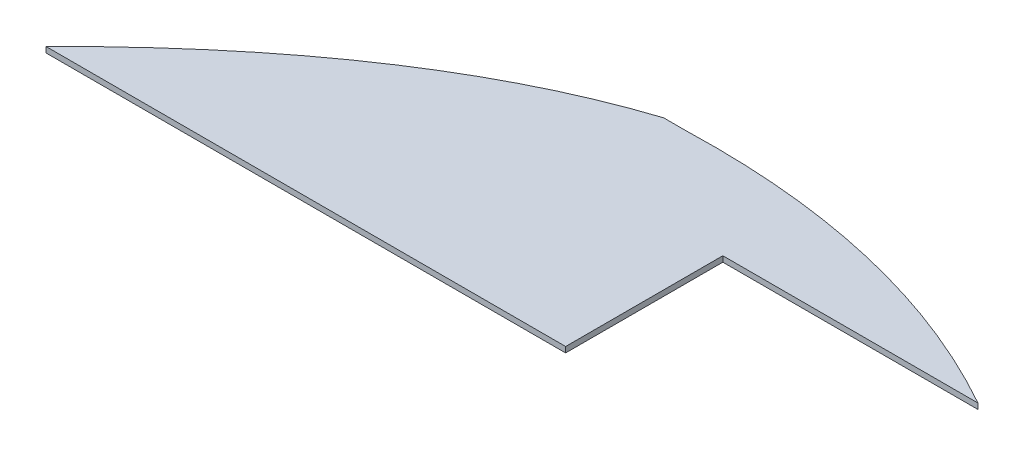
ISO-10303-21;
HEADER;
FILE_DESCRIPTION(('STEP AP214'),'2;1');
FILE_NAME('part.step','',(''),(''),'','','');
FILE_SCHEMA(('AUTOMOTIVE_DESIGN { 1 0 10303 214 1 1 1 1 }'));
ENDSEC;
DATA;
#1=APPLICATION_CONTEXT('core data for automotive mechanical design processes');
#2=APPLICATION_PROTOCOL_DEFINITION('international standard','automotive_design',2000,#1);
#3=PRODUCT_CONTEXT('',#1,'mechanical');
#4=PRODUCT('Part','Part','',(#3));
#5=PRODUCT_RELATED_PRODUCT_CATEGORY('part','',(#4));
#6=PRODUCT_DEFINITION_FORMATION('','',#4);
#7=PRODUCT_DEFINITION_CONTEXT('part definition',#1,'design');
#8=PRODUCT_DEFINITION('design','',#6,#7);
#9=PRODUCT_DEFINITION_SHAPE('','',#8);
#10=(LENGTH_UNIT() NAMED_UNIT(*) SI_UNIT(.MILLI.,.METRE.));
#11=(NAMED_UNIT(*) PLANE_ANGLE_UNIT() SI_UNIT($,.RADIAN.));
#12=(NAMED_UNIT(*) SI_UNIT($,.STERADIAN.) SOLID_ANGLE_UNIT());
#13=UNCERTAINTY_MEASURE_WITH_UNIT(LENGTH_MEASURE(1.E-05),#10,'distance_accuracy_value','');
#14=(GEOMETRIC_REPRESENTATION_CONTEXT(3) GLOBAL_UNCERTAINTY_ASSIGNED_CONTEXT((#13)) GLOBAL_UNIT_ASSIGNED_CONTEXT((#10,
#11,#12)) REPRESENTATION_CONTEXT('',''));
#15=CARTESIAN_POINT('',(0.,0.,0.));
#16=DIRECTION('',(0.,0.,1.));
#17=DIRECTION('',(1.,0.,0.));
#18=AXIS2_PLACEMENT_3D('',#15,#16,#17);
#19=CARTESIAN_POINT('',(-923.849215906296,1396.06710603682,1121.25452346778));
#20=CARTESIAN_POINT('',(-783.090401046879,1396.06710603682,978.7666672417));
#21=CARTESIAN_POINT('',(-642.550953528989,1396.06710603682,886.467514623687));
#22=CARTESIAN_POINT('',(-504.749198230769,1396.06710603682,841.854556369505));
#23=B_SPLINE_CURVE_WITH_KNOTS('',3,(#19,#20,#21,#22),.UNSPECIFIED.,.F.,.F.,(4,4),(0.,1.),.UNSPECIFIED.);
#24=DIRECTION('',(0.,1.,0.));
#25=VECTOR('',#24,1.);
#26=SURFACE_OF_LINEAR_EXTRUSION('',#23,#25);
#27=CARTESIAN_POINT('',(-923.849215906296,1402.41710603682,1121.25452346778));
#28=CARTESIAN_POINT('',(-783.090401046879,1402.41710603682,978.7666672417));
#29=CARTESIAN_POINT('',(-642.550953528989,1402.41710603682,886.467514623687));
#30=CARTESIAN_POINT('',(-504.749198230769,1402.41710603682,841.854556369505));
#31=B_SPLINE_CURVE_WITH_KNOTS('',3,(#27,#28,#29,#30),.UNSPECIFIED.,.F.,.F.,(4,4),(0.,1.),.UNSPECIFIED.);
#32=CARTESIAN_POINT('',(-923.849215906296,1402.41710603682,1121.25452346778));
#33=VERTEX_POINT('',#32);
#34=CARTESIAN_POINT('',(-504.749198230769,1402.41710603682,841.854556369505));
#35=VERTEX_POINT('',#34);
#36=EDGE_CURVE('E118',#33,#35,#31,.T.);
#37=ORIENTED_EDGE('',*,*,#36,.T.);
#38=DIRECTION('',(0.,1.,0.));
#39=VECTOR('',#38,1.);
#40=CARTESIAN_POINT('',(-504.749198230769,1396.06710603682,841.854556369505));
#41=LINE('',#40,#39);
#42=CARTESIAN_POINT('',(-504.749198230769,1396.06710603682,841.854556369505));
#43=VERTEX_POINT('',#42);
#44=EDGE_CURVE('E11',#43,#35,#41,.T.);
#45=ORIENTED_EDGE('',*,*,#44,.F.);
#46=CARTESIAN_POINT('',(-923.849215906296,1396.06710603682,1121.25452346778));
#47=VERTEX_POINT('',#46);
#48=EDGE_CURVE('E138',#47,#43,#23,.T.);
#49=ORIENTED_EDGE('',*,*,#48,.F.);
#50=DIRECTION('',(0.,1.,0.));
#51=VECTOR('',#50,1.);
#52=CARTESIAN_POINT('',(-923.849215906296,1396.06710603682,1121.25452346778));
#53=LINE('',#52,#51);
#54=EDGE_CURVE('E114',#47,#33,#53,.T.);
#55=ORIENTED_EDGE('',*,*,#54,.T.);
#56=EDGE_LOOP('',(#37,#45,#49,#55));
#57=FACE_BOUND('',#56,.T.);
#58=ADVANCED_FACE('F33',(#57),#26,.F.);
#59=CARTESIAN_POINT('',(-479.34919823077,1396.06710603682,841.854556369505));
#60=DIRECTION('',(0.,0.,1.));
#61=DIRECTION('',(0.,-1.,0.));
#62=AXIS2_PLACEMENT_3D('',#59,#60,#61);
#63=PLANE('',#62);
#64=DIRECTION('',(1.,0.,0.));
#65=VECTOR('',#64,1.);
#66=CARTESIAN_POINT('',(-479.34919823077,1402.41710603682,841.854556369505));
#67=LINE('',#66,#65);
#68=CARTESIAN_POINT('',(-479.34919823077,1402.41710603682,841.854556369505));
#69=VERTEX_POINT('',#68);
#70=EDGE_CURVE('E123',#35,#69,#67,.T.);
#71=ORIENTED_EDGE('',*,*,#70,.T.);
#72=DIRECTION('',(0.,1.,0.));
#73=VECTOR('',#72,1.);
#74=CARTESIAN_POINT('',(-479.34919823077,1396.06710603682,841.854556369505));
#75=LINE('',#74,#73);
#76=CARTESIAN_POINT('',(-479.34919823077,1396.06710603682,841.854556369505));
#77=VERTEX_POINT('',#76);
#78=EDGE_CURVE('E42',#77,#69,#75,.T.);
#79=ORIENTED_EDGE('',*,*,#78,.F.);
#80=DIRECTION('',(1.,0.,0.));
#81=VECTOR('',#80,1.);
#82=CARTESIAN_POINT('',(-479.34919823077,1396.06710603682,841.854556369505));
#83=LINE('',#82,#81);
#84=EDGE_CURVE('E87',#43,#77,#83,.T.);
#85=ORIENTED_EDGE('',*,*,#84,.F.);
#86=ORIENTED_EDGE('',*,*,#44,.T.);
#87=EDGE_LOOP('',(#71,#79,#85,#86));
#88=FACE_BOUND('',#87,.T.);
#89=ADVANCED_FACE('F162',(#88),#63,.F.);
#90=CARTESIAN_POINT('',(-479.34919823077,1396.06710603682,841.854556369505));
#91=CARTESIAN_POINT('',(-241.540116372837,1396.06710603682,834.468534000656));
#92=CARTESIAN_POINT('',(-47.5491982307663,1396.06710603682,943.454556369519));
#93=B_SPLINE_CURVE_WITH_KNOTS('',2,(#90,#91,#92),.UNSPECIFIED.,.F.,.F.,(3,3),(0.,1.),.UNSPECIFIED.);
#94=DIRECTION('',(0.,1.,0.));
#95=VECTOR('',#94,1.);
#96=SURFACE_OF_LINEAR_EXTRUSION('',#93,#95);
#97=CARTESIAN_POINT('',(-479.34919823077,1402.41710603682,841.854556369505));
#98=CARTESIAN_POINT('',(-241.540116372837,1402.41710603682,834.468534000656));
#99=CARTESIAN_POINT('',(-47.5491982307663,1402.41710603682,943.454556369519));
#100=B_SPLINE_CURVE_WITH_KNOTS('',2,(#97,#98,#99),.UNSPECIFIED.,.F.,.F.,(3,3),(0.,1.),.UNSPECIFIED.);
#101=CARTESIAN_POINT('',(-47.5491982307664,1402.41710603682,943.454556369519));
#102=VERTEX_POINT('',#101);
#103=EDGE_CURVE('E128',#69,#102,#100,.T.);
#104=ORIENTED_EDGE('',*,*,#103,.T.);
#105=DIRECTION('',(0.,1.,0.));
#106=VECTOR('',#105,1.);
#107=CARTESIAN_POINT('',(-47.5491982307664,1396.06710603682,943.454556369519));
#108=LINE('',#107,#106);
#109=CARTESIAN_POINT('',(-47.5491982307664,1396.06710603682,943.454556369519));
#110=VERTEX_POINT('',#109);
#111=EDGE_CURVE('E109',#110,#102,#108,.T.);
#112=ORIENTED_EDGE('',*,*,#111,.F.);
#113=EDGE_CURVE('E100',#77,#110,#93,.T.);
#114=ORIENTED_EDGE('',*,*,#113,.F.);
#115=ORIENTED_EDGE('',*,*,#78,.T.);
#116=EDGE_LOOP('',(#104,#112,#114,#115));
#117=FACE_BOUND('',#116,.T.);
#118=ADVANCED_FACE('F144',(#117),#96,.F.);
#119=CARTESIAN_POINT('',(-336.146804180864,1396.06710603682,943.454556369515));
#120=DIRECTION('',(0.,0.,-1.));
#121=DIRECTION('',(-1.,0.,0.));
#122=AXIS2_PLACEMENT_3D('',#119,#120,#121);
#123=PLANE('',#122);
#124=DIRECTION('',(-1.,0.,0.));
#125=VECTOR('',#124,1.);
#126=CARTESIAN_POINT('',(-336.146804180864,1402.41710603682,943.454556369515));
#127=LINE('',#126,#125);
#128=CARTESIAN_POINT('',(-336.146804180864,1402.41710603682,943.454556369515));
#129=VERTEX_POINT('',#128);
#130=EDGE_CURVE('E108',#102,#129,#127,.T.);
#131=ORIENTED_EDGE('',*,*,#130,.T.);
#132=DIRECTION('',(0.,1.,0.));
#133=VECTOR('',#132,1.);
#134=CARTESIAN_POINT('',(-336.146804180864,1396.06710603682,943.454556369515));
#135=LINE('',#134,#133);
#136=CARTESIAN_POINT('',(-336.146804180864,1396.06710603682,943.454556369515));
#137=VERTEX_POINT('',#136);
#138=EDGE_CURVE('E105',#137,#129,#135,.T.);
#139=ORIENTED_EDGE('',*,*,#138,.F.);
#140=DIRECTION('',(-1.,0.,0.));
#141=VECTOR('',#140,1.);
#142=CARTESIAN_POINT('',(-336.146804180864,1396.06710603682,943.454556369515));
#143=LINE('',#142,#141);
#144=EDGE_CURVE('E94',#110,#137,#143,.T.);
#145=ORIENTED_EDGE('',*,*,#144,.F.);
#146=ORIENTED_EDGE('',*,*,#111,.T.);
#147=EDGE_LOOP('',(#131,#139,#145,#146));
#148=FACE_BOUND('',#147,.T.);
#149=ADVANCED_FACE('F106',(#148),#123,.F.);
#150=CARTESIAN_POINT('',(-336.146804180864,1396.06710603682,1121.25455636952));
#151=DIRECTION('',(-1.,0.,0.));
#152=DIRECTION('',(0.,0.,1.));
#153=AXIS2_PLACEMENT_3D('',#150,#151,#152);
#154=PLANE('',#153);
#155=DIRECTION('',(0.,0.,1.));
#156=VECTOR('',#155,1.);
#157=CARTESIAN_POINT('',(-336.146804180864,1402.41710603682,1121.25455636952));
#158=LINE('',#157,#156);
#159=CARTESIAN_POINT('',(-336.146804180864,1402.41710603682,1121.25455636952));
#160=VERTEX_POINT('',#159);
#161=EDGE_CURVE('E73',#129,#160,#158,.T.);
#162=ORIENTED_EDGE('',*,*,#161,.T.);
#163=DIRECTION('',(0.,1.,0.));
#164=VECTOR('',#163,1.);
#165=CARTESIAN_POINT('',(-336.146804180864,1396.06710603682,1121.25455636952));
#166=LINE('',#165,#164);
#167=CARTESIAN_POINT('',(-336.146804180864,1396.06710603682,1121.25455636952));
#168=VERTEX_POINT('',#167);
#169=EDGE_CURVE('E110',#168,#160,#166,.T.);
#170=ORIENTED_EDGE('',*,*,#169,.F.);
#171=DIRECTION('',(0.,0.,1.));
#172=VECTOR('',#171,1.);
#173=CARTESIAN_POINT('',(-336.146804180864,1396.06710603682,1121.25455636952));
#174=LINE('',#173,#172);
#175=EDGE_CURVE('E98',#137,#168,#174,.T.);
#176=ORIENTED_EDGE('',*,*,#175,.F.);
#177=ORIENTED_EDGE('',*,*,#138,.T.);
#178=EDGE_LOOP('',(#162,#170,#176,#177));
#179=FACE_BOUND('',#178,.T.);
#180=ADVANCED_FACE('F112',(#179),#154,.F.);
#181=CARTESIAN_POINT('',(-923.849215906296,1396.06710603682,1121.25452346778));
#182=DIRECTION('',(5.59836732343951E-08,0.,-0.999999999999998));
#183=DIRECTION('',(-0.999999999999999,0.,-5.59836732343951E-08));
#184=AXIS2_PLACEMENT_3D('',#181,#182,#183);
#185=PLANE('',#184);
#186=DIRECTION('',(-0.999999999999998,0.,-5.59836732343951E-08));
#187=VECTOR('',#186,1.);
#188=CARTESIAN_POINT('',(-923.849215906296,1402.41710603682,1121.25452346778));
#189=LINE('',#188,#187);
#190=EDGE_CURVE('E79',#160,#33,#189,.T.);
#191=ORIENTED_EDGE('',*,*,#190,.T.);
#192=ORIENTED_EDGE('',*,*,#54,.F.);
#193=DIRECTION('',(-0.999999999999998,0.,-5.59836732343951E-08));
#194=VECTOR('',#193,1.);
#195=CARTESIAN_POINT('',(-923.849215906296,1396.06710603682,1121.25452346778));
#196=LINE('',#195,#194);
#197=EDGE_CURVE('E50',#168,#47,#196,.T.);
#198=ORIENTED_EDGE('',*,*,#197,.F.);
#199=ORIENTED_EDGE('',*,*,#169,.T.);
#200=EDGE_LOOP('',(#191,#192,#198,#199));
#201=FACE_BOUND('',#200,.T.);
#202=ADVANCED_FACE('F151',(#201),#185,.F.);
#203=CARTESIAN_POINT('',(-713.190309733084,1396.06710603682,944.85145317918));
#204=DIRECTION('',(0.,1.,0.));
#205=DIRECTION('',(0.,0.,1.));
#206=AXIS2_PLACEMENT_3D('',#203,#204,#205);
#207=PLANE('',#206);
#208=ORIENTED_EDGE('',*,*,#48,.T.);
#209=ORIENTED_EDGE('',*,*,#84,.T.);
#210=ORIENTED_EDGE('',*,*,#113,.T.);
#211=ORIENTED_EDGE('',*,*,#144,.T.);
#212=ORIENTED_EDGE('',*,*,#175,.T.);
#213=ORIENTED_EDGE('',*,*,#197,.T.);
#214=EDGE_LOOP('',(#208,#209,#210,#211,#212,#213));
#215=FACE_BOUND('',#214,.T.);
#216=ADVANCED_FACE('F96',(#215),#207,.F.);
#217=CARTESIAN_POINT('',(-713.190309733084,1402.41710603682,944.85145317918));
#218=DIRECTION('',(0.,1.,0.));
#219=DIRECTION('',(0.,0.,1.));
#220=AXIS2_PLACEMENT_3D('',#217,#218,#219);
#221=PLANE('',#220);
#222=ORIENTED_EDGE('',*,*,#36,.F.);
#223=ORIENTED_EDGE('',*,*,#190,.F.);
#224=ORIENTED_EDGE('',*,*,#161,.F.);
#225=ORIENTED_EDGE('',*,*,#130,.F.);
#226=ORIENTED_EDGE('',*,*,#103,.F.);
#227=ORIENTED_EDGE('',*,*,#70,.F.);
#228=EDGE_LOOP('',(#222,#223,#224,#225,#226,#227));
#229=FACE_BOUND('',#228,.T.);
#230=ADVANCED_FACE('F147',(#229),#221,.T.);
#231=CLOSED_SHELL('',(#58,#89,#118,#149,#180,#202,#216,#230));
#232=MANIFOLD_SOLID_BREP('B2',#231);
#233=ADVANCED_BREP_SHAPE_REPRESENTATION('',(#18,#232),#14);
#234=SHAPE_DEFINITION_REPRESENTATION(#9,#233);
ENDSEC;
END-ISO-10303-21;
